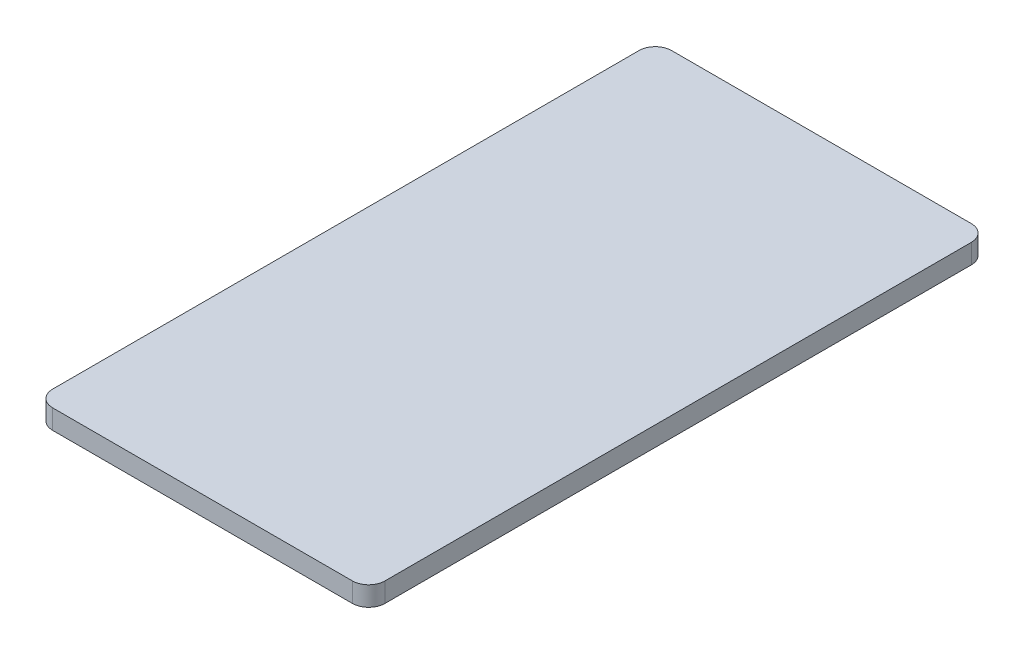
ISO-10303-21;
HEADER;
FILE_DESCRIPTION(('STEP AP214'),'2;1');
FILE_NAME('part.step','',(''),(''),'','','');
FILE_SCHEMA(('AUTOMOTIVE_DESIGN { 1 0 10303 214 1 1 1 1 }'));
ENDSEC;
DATA;
#1=APPLICATION_CONTEXT('core data for automotive mechanical design processes');
#2=APPLICATION_PROTOCOL_DEFINITION('international standard','automotive_design',2000,#1);
#3=PRODUCT_CONTEXT('',#1,'mechanical');
#4=PRODUCT('Part','Part','',(#3));
#5=PRODUCT_RELATED_PRODUCT_CATEGORY('part','',(#4));
#6=PRODUCT_DEFINITION_FORMATION('','',#4);
#7=PRODUCT_DEFINITION_CONTEXT('part definition',#1,'design');
#8=PRODUCT_DEFINITION('design','',#6,#7);
#9=PRODUCT_DEFINITION_SHAPE('','',#8);
#10=(LENGTH_UNIT() NAMED_UNIT(*) SI_UNIT(.MILLI.,.METRE.));
#11=(NAMED_UNIT(*) PLANE_ANGLE_UNIT() SI_UNIT($,.RADIAN.));
#12=(NAMED_UNIT(*) SI_UNIT($,.STERADIAN.) SOLID_ANGLE_UNIT());
#13=UNCERTAINTY_MEASURE_WITH_UNIT(LENGTH_MEASURE(1.E-05),#10,'distance_accuracy_value','');
#14=(GEOMETRIC_REPRESENTATION_CONTEXT(3) GLOBAL_UNCERTAINTY_ASSIGNED_CONTEXT((#13)) GLOBAL_UNIT_ASSIGNED_CONTEXT((#10,
#11,#12)) REPRESENTATION_CONTEXT('',''));
#15=CARTESIAN_POINT('',(0.,0.,0.));
#16=DIRECTION('',(0.,0.,1.));
#17=DIRECTION('',(1.,0.,0.));
#18=AXIS2_PLACEMENT_3D('',#15,#16,#17);
#19=CARTESIAN_POINT('',(9.41,2.59,-15.));
#20=DIRECTION('',(0.,0.,-1.));
#21=DIRECTION('',(-1.,0.,0.));
#22=AXIS2_PLACEMENT_3D('',#19,#20,#21);
#23=PLANE('',#22);
#24=DIRECTION('',(0.,-1.,0.));
#25=VECTOR('',#24,1.);
#26=CARTESIAN_POINT('',(-9.,3.2,-15.));
#27=LINE('',#26,#25);
#28=CARTESIAN_POINT('',(-9.,3.8,-15.));
#29=VERTEX_POINT('',#28);
#30=CARTESIAN_POINT('',(-9.,2.6,-15.));
#31=VERTEX_POINT('',#30);
#32=EDGE_CURVE('E133',#29,#31,#27,.T.);
#33=ORIENTED_EDGE('',*,*,#32,.F.);
#34=DIRECTION('',(-1.,0.,0.));
#35=VECTOR('',#34,1.);
#36=CARTESIAN_POINT('',(0.200000000000001,3.8,-15.));
#37=LINE('',#36,#35);
#38=CARTESIAN_POINT('',(9.4,3.8,-15.));
#39=VERTEX_POINT('',#38);
#40=EDGE_CURVE('E106',#39,#29,#37,.T.);
#41=ORIENTED_EDGE('',*,*,#40,.F.);
#42=DIRECTION('',(0.,1.,0.));
#43=VECTOR('',#42,1.);
#44=CARTESIAN_POINT('',(9.4,3.2,-15.));
#45=LINE('',#44,#43);
#46=CARTESIAN_POINT('',(9.4,2.6,-15.));
#47=VERTEX_POINT('',#46);
#48=EDGE_CURVE('E135',#47,#39,#45,.T.);
#49=ORIENTED_EDGE('',*,*,#48,.F.);
#50=DIRECTION('',(1.,0.,0.));
#51=VECTOR('',#50,1.);
#52=CARTESIAN_POINT('',(0.200000000000001,2.6,-15.));
#53=LINE('',#52,#51);
#54=EDGE_CURVE('E120',#31,#47,#53,.T.);
#55=ORIENTED_EDGE('',*,*,#54,.F.);
#56=EDGE_LOOP('',(#33,#41,#49,#55));
#57=FACE_BOUND('',#56,.T.);
#58=ADVANCED_FACE('F16',(#57),#23,.T.);
#59=CARTESIAN_POINT('',(-9.,3.8,-14.));
#60=DIRECTION('',(0.,-1.,0.));
#61=DIRECTION('',(0.,0.,-1.));
#62=AXIS2_PLACEMENT_3D('',#59,#60,#61);
#63=CYLINDRICAL_SURFACE('',#62,0.999999999999999);
#64=CARTESIAN_POINT('',(-9.,2.6,-14.));
#65=DIRECTION('',(0.,-1.,0.));
#66=DIRECTION('',(0.,0.,-1.));
#67=AXIS2_PLACEMENT_3D('',#64,#65,#66);
#68=CIRCLE('',#67,0.999999999999999);
#69=CARTESIAN_POINT('',(-10.,2.6,-14.));
#70=VERTEX_POINT('',#69);
#71=EDGE_CURVE('E123',#70,#31,#68,.T.);
#72=ORIENTED_EDGE('',*,*,#71,.F.);
#73=DIRECTION('',(0.,-1.,0.));
#74=VECTOR('',#73,1.);
#75=CARTESIAN_POINT('',(-10.,3.2,-14.));
#76=LINE('',#75,#74);
#77=CARTESIAN_POINT('',(-10.,3.8,-14.));
#78=VERTEX_POINT('',#77);
#79=EDGE_CURVE('E90',#78,#70,#76,.T.);
#80=ORIENTED_EDGE('',*,*,#79,.F.);
#81=CARTESIAN_POINT('',(-9.,3.8,-14.));
#82=DIRECTION('',(0.,-1.,0.));
#83=DIRECTION('',(0.,0.,-1.));
#84=AXIS2_PLACEMENT_3D('',#81,#82,#83);
#85=CIRCLE('',#84,0.999999999999999);
#86=EDGE_CURVE('E104',#29,#78,#85,.F.);
#87=ORIENTED_EDGE('',*,*,#86,.F.);
#88=ORIENTED_EDGE('',*,*,#32,.T.);
#89=EDGE_LOOP('',(#72,#80,#87,#88));
#90=FACE_BOUND('',#89,.T.);
#91=ADVANCED_FACE('F162',(#90),#63,.T.);
#92=CARTESIAN_POINT('',(-10.,2.59,-14.01));
#93=DIRECTION('',(-1.,0.,0.));
#94=DIRECTION('',(0.,0.,1.));
#95=AXIS2_PLACEMENT_3D('',#92,#93,#94);
#96=PLANE('',#95);
#97=ORIENTED_EDGE('',*,*,#79,.T.);
#98=DIRECTION('',(0.,0.,-1.));
#99=VECTOR('',#98,1.);
#100=CARTESIAN_POINT('',(-10.,2.6,4.));
#101=LINE('',#100,#99);
#102=CARTESIAN_POINT('',(-10.,2.6,22.));
#103=VERTEX_POINT('',#102);
#104=EDGE_CURVE('E85',#103,#70,#101,.T.);
#105=ORIENTED_EDGE('',*,*,#104,.F.);
#106=DIRECTION('',(0.,-1.,0.));
#107=VECTOR('',#106,1.);
#108=CARTESIAN_POINT('',(-10.,3.2,22.));
#109=LINE('',#108,#107);
#110=CARTESIAN_POINT('',(-10.,3.8,22.));
#111=VERTEX_POINT('',#110);
#112=EDGE_CURVE('E78',#111,#103,#109,.T.);
#113=ORIENTED_EDGE('',*,*,#112,.F.);
#114=DIRECTION('',(0.,0.,1.));
#115=VECTOR('',#114,1.);
#116=CARTESIAN_POINT('',(-10.,3.8,4.));
#117=LINE('',#116,#115);
#118=EDGE_CURVE('E82',#78,#111,#117,.T.);
#119=ORIENTED_EDGE('',*,*,#118,.F.);
#120=EDGE_LOOP('',(#97,#105,#113,#119));
#121=FACE_BOUND('',#120,.T.);
#122=ADVANCED_FACE('F80',(#121),#96,.T.);
#123=CARTESIAN_POINT('',(-9.,3.8,22.));
#124=DIRECTION('',(0.,-1.,0.));
#125=DIRECTION('',(0.,0.,-1.));
#126=AXIS2_PLACEMENT_3D('',#123,#124,#125);
#127=CYLINDRICAL_SURFACE('',#126,0.999999999999999);
#128=CARTESIAN_POINT('',(-9.,2.6,22.));
#129=DIRECTION('',(0.,-1.,0.));
#130=DIRECTION('',(0.,0.,-1.));
#131=AXIS2_PLACEMENT_3D('',#128,#129,#130);
#132=CIRCLE('',#131,0.999999999999999);
#133=CARTESIAN_POINT('',(-9.,2.6,23.));
#134=VERTEX_POINT('',#133);
#135=EDGE_CURVE('E125',#134,#103,#132,.T.);
#136=ORIENTED_EDGE('',*,*,#135,.F.);
#137=DIRECTION('',(0.,-1.,0.));
#138=VECTOR('',#137,1.);
#139=CARTESIAN_POINT('',(-9.,3.2,23.));
#140=LINE('',#139,#138);
#141=CARTESIAN_POINT('',(-9.,3.8,23.));
#142=VERTEX_POINT('',#141);
#143=EDGE_CURVE('E95',#142,#134,#140,.T.);
#144=ORIENTED_EDGE('',*,*,#143,.F.);
#145=CARTESIAN_POINT('',(-9.,3.8,22.));
#146=DIRECTION('',(0.,-1.,0.));
#147=DIRECTION('',(0.,0.,-1.));
#148=AXIS2_PLACEMENT_3D('',#145,#146,#147);
#149=CIRCLE('',#148,0.999999999999999);
#150=EDGE_CURVE('E93',#111,#142,#149,.F.);
#151=ORIENTED_EDGE('',*,*,#150,.F.);
#152=ORIENTED_EDGE('',*,*,#112,.T.);
#153=EDGE_LOOP('',(#136,#144,#151,#152));
#154=FACE_BOUND('',#153,.T.);
#155=ADVANCED_FACE('F94',(#154),#127,.T.);
#156=CARTESIAN_POINT('',(-9.01,2.59,23.));
#157=DIRECTION('',(0.,0.,1.));
#158=DIRECTION('',(1.,0.,0.));
#159=AXIS2_PLACEMENT_3D('',#156,#157,#158);
#160=PLANE('',#159);
#161=ORIENTED_EDGE('',*,*,#143,.T.);
#162=DIRECTION('',(-1.,0.,0.));
#163=VECTOR('',#162,1.);
#164=CARTESIAN_POINT('',(0.200000000000001,2.6,23.));
#165=LINE('',#164,#163);
#166=CARTESIAN_POINT('',(9.4,2.6,23.));
#167=VERTEX_POINT('',#166);
#168=EDGE_CURVE('E126',#167,#134,#165,.T.);
#169=ORIENTED_EDGE('',*,*,#168,.F.);
#170=DIRECTION('',(0.,1.,0.));
#171=VECTOR('',#170,1.);
#172=CARTESIAN_POINT('',(9.4,3.2,23.));
#173=LINE('',#172,#171);
#174=CARTESIAN_POINT('',(9.4,3.8,23.));
#175=VERTEX_POINT('',#174);
#176=EDGE_CURVE('E89',#167,#175,#173,.T.);
#177=ORIENTED_EDGE('',*,*,#176,.T.);
#178=DIRECTION('',(1.,0.,0.));
#179=VECTOR('',#178,1.);
#180=CARTESIAN_POINT('',(0.200000000000001,3.8,23.));
#181=LINE('',#180,#179);
#182=EDGE_CURVE('E99',#142,#175,#181,.T.);
#183=ORIENTED_EDGE('',*,*,#182,.F.);
#184=EDGE_LOOP('',(#161,#169,#177,#183));
#185=FACE_BOUND('',#184,.T.);
#186=ADVANCED_FACE('F148',(#185),#160,.T.);
#187=CARTESIAN_POINT('',(-10.01,2.6,23.01));
#188=DIRECTION('',(0.,-1.,0.));
#189=DIRECTION('',(0.,0.,-1.));
#190=AXIS2_PLACEMENT_3D('',#187,#188,#189);
#191=PLANE('',#190);
#192=CARTESIAN_POINT('',(9.4,2.6,-14.));
#193=DIRECTION('',(0.,-1.,0.));
#194=DIRECTION('',(0.,0.,-1.));
#195=AXIS2_PLACEMENT_3D('',#192,#193,#194);
#196=CIRCLE('',#195,1.);
#197=CARTESIAN_POINT('',(10.4,2.6,-14.));
#198=VERTEX_POINT('',#197);
#199=EDGE_CURVE('E122',#198,#47,#196,.F.);
#200=ORIENTED_EDGE('',*,*,#199,.F.);
#201=DIRECTION('',(0.,0.,-1.));
#202=VECTOR('',#201,1.);
#203=CARTESIAN_POINT('',(10.4,2.6,4.));
#204=LINE('',#203,#202);
#205=CARTESIAN_POINT('',(10.4,2.6,22.));
#206=VERTEX_POINT('',#205);
#207=EDGE_CURVE('E115',#206,#198,#204,.T.);
#208=ORIENTED_EDGE('',*,*,#207,.F.);
#209=CARTESIAN_POINT('',(9.4,2.6,22.));
#210=DIRECTION('',(0.,-1.,0.));
#211=DIRECTION('',(0.,0.,-1.));
#212=AXIS2_PLACEMENT_3D('',#209,#210,#211);
#213=CIRCLE('',#212,1.);
#214=EDGE_CURVE('E20',#206,#167,#213,.T.);
#215=ORIENTED_EDGE('',*,*,#214,.T.);
#216=ORIENTED_EDGE('',*,*,#168,.T.);
#217=ORIENTED_EDGE('',*,*,#135,.T.);
#218=ORIENTED_EDGE('',*,*,#104,.T.);
#219=ORIENTED_EDGE('',*,*,#71,.T.);
#220=ORIENTED_EDGE('',*,*,#54,.T.);
#221=EDGE_LOOP('',(#200,#208,#215,#216,#217,#218,#219,#220));
#222=FACE_BOUND('',#221,.T.);
#223=ADVANCED_FACE('F145',(#222),#191,.T.);
#224=CARTESIAN_POINT('',(9.4,3.8,-14.));
#225=DIRECTION('',(0.,-1.,0.));
#226=DIRECTION('',(0.,0.,-1.));
#227=AXIS2_PLACEMENT_3D('',#224,#225,#226);
#228=CYLINDRICAL_SURFACE('',#227,1.);
#229=ORIENTED_EDGE('',*,*,#199,.T.);
#230=ORIENTED_EDGE('',*,*,#48,.T.);
#231=CARTESIAN_POINT('',(9.4,3.8,-14.));
#232=DIRECTION('',(0.,-1.,0.));
#233=DIRECTION('',(0.,0.,-1.));
#234=AXIS2_PLACEMENT_3D('',#231,#232,#233);
#235=CIRCLE('',#234,1.);
#236=CARTESIAN_POINT('',(10.4,3.8,-14.));
#237=VERTEX_POINT('',#236);
#238=EDGE_CURVE('E111',#237,#39,#235,.F.);
#239=ORIENTED_EDGE('',*,*,#238,.F.);
#240=DIRECTION('',(0.,1.,0.));
#241=VECTOR('',#240,1.);
#242=CARTESIAN_POINT('',(10.4,3.2,-14.));
#243=LINE('',#242,#241);
#244=EDGE_CURVE('E112',#198,#237,#243,.T.);
#245=ORIENTED_EDGE('',*,*,#244,.F.);
#246=EDGE_LOOP('',(#229,#230,#239,#245));
#247=FACE_BOUND('',#246,.T.);
#248=ADVANCED_FACE('F155',(#247),#228,.T.);
#249=CARTESIAN_POINT('',(-10.01,3.8,-15.01));
#250=DIRECTION('',(0.,1.,0.));
#251=DIRECTION('',(0.,0.,1.));
#252=AXIS2_PLACEMENT_3D('',#249,#250,#251);
#253=PLANE('',#252);
#254=ORIENTED_EDGE('',*,*,#150,.T.);
#255=ORIENTED_EDGE('',*,*,#182,.T.);
#256=CARTESIAN_POINT('',(9.4,3.8,22.));
#257=DIRECTION('',(0.,-1.,0.));
#258=DIRECTION('',(0.,0.,-1.));
#259=AXIS2_PLACEMENT_3D('',#256,#257,#258);
#260=CIRCLE('',#259,1.);
#261=CARTESIAN_POINT('',(10.4,3.8,22.));
#262=VERTEX_POINT('',#261);
#263=EDGE_CURVE('E136',#175,#262,#260,.F.);
#264=ORIENTED_EDGE('',*,*,#263,.T.);
#265=DIRECTION('',(0.,0.,1.));
#266=VECTOR('',#265,1.);
#267=CARTESIAN_POINT('',(10.4,3.8,4.));
#268=LINE('',#267,#266);
#269=EDGE_CURVE('E26',#237,#262,#268,.T.);
#270=ORIENTED_EDGE('',*,*,#269,.F.);
#271=ORIENTED_EDGE('',*,*,#238,.T.);
#272=ORIENTED_EDGE('',*,*,#40,.T.);
#273=ORIENTED_EDGE('',*,*,#86,.T.);
#274=ORIENTED_EDGE('',*,*,#118,.T.);
#275=EDGE_LOOP('',(#254,#255,#264,#270,#271,#272,#273,#274));
#276=FACE_BOUND('',#275,.T.);
#277=ADVANCED_FACE('F101',(#276),#253,.T.);
#278=CARTESIAN_POINT('',(10.4,2.59,22.01));
#279=DIRECTION('',(1.,0.,0.));
#280=DIRECTION('',(0.,0.,-1.));
#281=AXIS2_PLACEMENT_3D('',#278,#279,#280);
#282=PLANE('',#281);
#283=ORIENTED_EDGE('',*,*,#244,.T.);
#284=ORIENTED_EDGE('',*,*,#269,.T.);
#285=DIRECTION('',(0.,1.,0.));
#286=VECTOR('',#285,1.);
#287=CARTESIAN_POINT('',(10.4,3.2,22.));
#288=LINE('',#287,#286);
#289=EDGE_CURVE('E11',#206,#262,#288,.T.);
#290=ORIENTED_EDGE('',*,*,#289,.F.);
#291=ORIENTED_EDGE('',*,*,#207,.T.);
#292=EDGE_LOOP('',(#283,#284,#290,#291));
#293=FACE_BOUND('',#292,.T.);
#294=ADVANCED_FACE('F152',(#293),#282,.T.);
#295=CARTESIAN_POINT('',(9.4,3.8,22.));
#296=DIRECTION('',(0.,-1.,0.));
#297=DIRECTION('',(0.,0.,-1.));
#298=AXIS2_PLACEMENT_3D('',#295,#296,#297);
#299=CYLINDRICAL_SURFACE('',#298,1.);
#300=ORIENTED_EDGE('',*,*,#214,.F.);
#301=ORIENTED_EDGE('',*,*,#289,.T.);
#302=ORIENTED_EDGE('',*,*,#263,.F.);
#303=ORIENTED_EDGE('',*,*,#176,.F.);
#304=EDGE_LOOP('',(#300,#301,#302,#303));
#305=FACE_BOUND('',#304,.T.);
#306=ADVANCED_FACE('F18',(#305),#299,.T.);
#307=CLOSED_SHELL('',(#58,#91,#122,#155,#186,#223,#248,#277,#294,#306));
#308=MANIFOLD_SOLID_BREP('B1',#307);
#309=ADVANCED_BREP_SHAPE_REPRESENTATION('',(#18,#308),#14);
#310=SHAPE_DEFINITION_REPRESENTATION(#9,#309);
ENDSEC;
END-ISO-10303-21;
